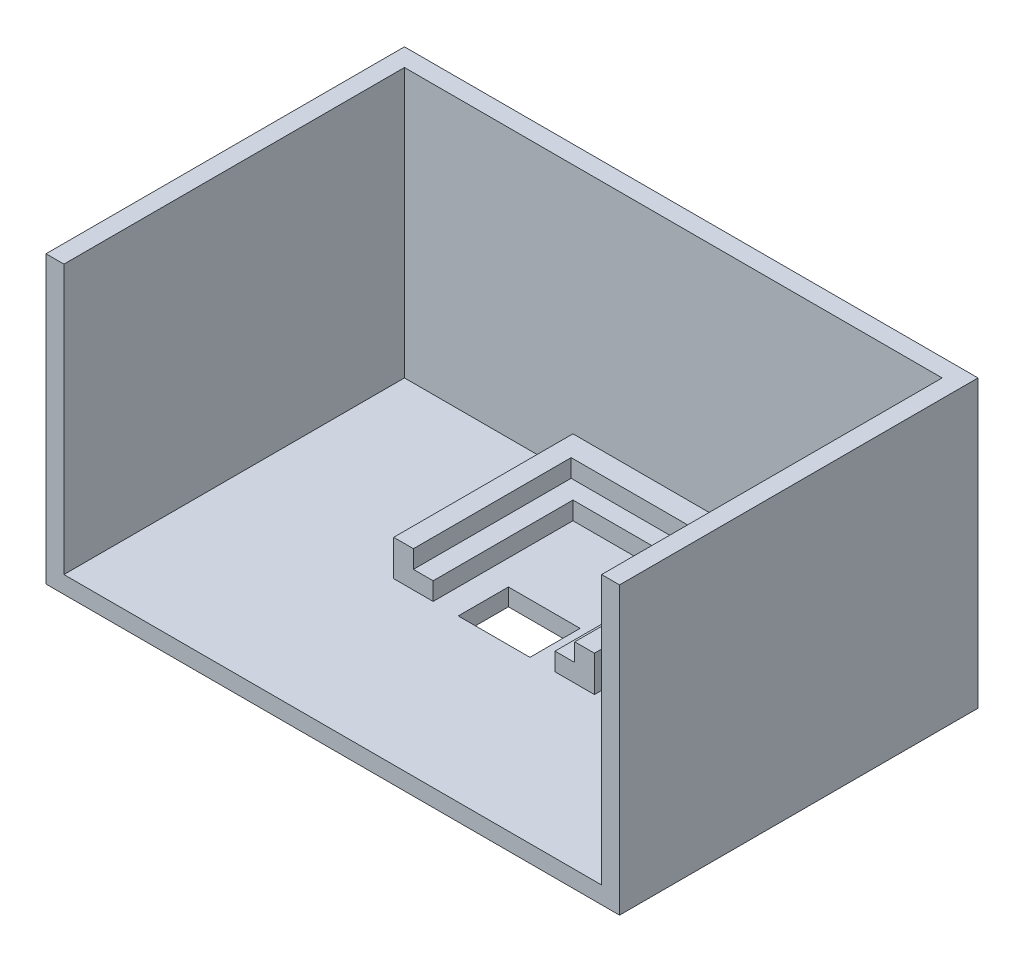
ISO-10303-21;
HEADER;
FILE_DESCRIPTION(('STEP AP214'),'2;1');
FILE_NAME('part.step','',(''),(''),'','','');
FILE_SCHEMA(('AUTOMOTIVE_DESIGN { 1 0 10303 214 1 1 1 1 }'));
ENDSEC;
DATA;
#1=APPLICATION_CONTEXT('core data for automotive mechanical design processes');
#2=APPLICATION_PROTOCOL_DEFINITION('international standard','automotive_design',2000,#1);
#3=PRODUCT_CONTEXT('',#1,'mechanical');
#4=PRODUCT('Part','Part','',(#3));
#5=PRODUCT_RELATED_PRODUCT_CATEGORY('part','',(#4));
#6=PRODUCT_DEFINITION_FORMATION('','',#4);
#7=PRODUCT_DEFINITION_CONTEXT('part definition',#1,'design');
#8=PRODUCT_DEFINITION('design','',#6,#7);
#9=PRODUCT_DEFINITION_SHAPE('','',#8);
#10=(LENGTH_UNIT() NAMED_UNIT(*) SI_UNIT(.MILLI.,.METRE.));
#11=(NAMED_UNIT(*) PLANE_ANGLE_UNIT() SI_UNIT($,.RADIAN.));
#12=(NAMED_UNIT(*) SI_UNIT($,.STERADIAN.) SOLID_ANGLE_UNIT());
#13=UNCERTAINTY_MEASURE_WITH_UNIT(LENGTH_MEASURE(1.E-05),#10,'distance_accuracy_value','');
#14=(GEOMETRIC_REPRESENTATION_CONTEXT(3) GLOBAL_UNCERTAINTY_ASSIGNED_CONTEXT((#13)) GLOBAL_UNIT_ASSIGNED_CONTEXT((#10,
#11,#12)) REPRESENTATION_CONTEXT('',''));
#15=CARTESIAN_POINT('',(0.,0.,0.));
#16=DIRECTION('',(0.,0.,1.));
#17=DIRECTION('',(1.,0.,0.));
#18=AXIS2_PLACEMENT_3D('',#15,#16,#17);
#19=CARTESIAN_POINT('',(-35.2096503229502,7.5,-34.0725635559515));
#20=DIRECTION('',(-1.,0.,0.));
#21=DIRECTION('',(0.,0.,1.));
#22=AXIS2_PLACEMENT_3D('',#19,#20,#21);
#23=PLANE('',#22);
#24=DIRECTION('',(0.,0.,-1.));
#25=VECTOR('',#24,1.);
#26=CARTESIAN_POINT('',(-35.2096503229502,5.,-34.0725635559515));
#27=LINE('',#26,#25);
#28=CARTESIAN_POINT('',(-35.2096503229502,5.,-14.5725635559515));
#29=VERTEX_POINT('',#28);
#30=CARTESIAN_POINT('',(-35.2096503229502,5.,-34.0725635559515));
#31=VERTEX_POINT('',#30);
#32=EDGE_CURVE('E240',#29,#31,#27,.T.);
#33=ORIENTED_EDGE('',*,*,#32,.F.);
#34=DIRECTION('',(0.,-1.,0.));
#35=VECTOR('',#34,1.);
#36=CARTESIAN_POINT('',(-35.2096503229502,7.5,-14.5725635559515));
#37=LINE('',#36,#35);
#38=CARTESIAN_POINT('',(-35.2096503229502,2.5,-14.5725635559515));
#39=VERTEX_POINT('',#38);
#40=EDGE_CURVE('E220',#29,#39,#37,.T.);
#41=ORIENTED_EDGE('',*,*,#40,.T.);
#42=DIRECTION('',(0.,0.,-1.));
#43=VECTOR('',#42,1.);
#44=CARTESIAN_POINT('',(-35.2096503229502,2.5,-34.0725635559515));
#45=LINE('',#44,#43);
#46=CARTESIAN_POINT('',(-35.2096503229502,2.5,-34.0725635559515));
#47=VERTEX_POINT('',#46);
#48=EDGE_CURVE('E284',#39,#47,#45,.T.);
#49=ORIENTED_EDGE('',*,*,#48,.T.);
#50=DIRECTION('',(0.,-1.,0.));
#51=VECTOR('',#50,1.);
#52=CARTESIAN_POINT('',(-35.2096503229502,7.5,-34.0725635559515));
#53=LINE('',#52,#51);
#54=EDGE_CURVE('E307',#31,#47,#53,.T.);
#55=ORIENTED_EDGE('',*,*,#54,.F.);
#56=EDGE_LOOP('',(#33,#41,#49,#55));
#57=FACE_BOUND('',#56,.T.);
#58=ADVANCED_FACE('F33',(#57),#23,.F.);
#59=CARTESIAN_POINT('',(-35.2096503229502,7.5,-34.0725635559515));
#60=DIRECTION('',(0.,0.,-1.));
#61=DIRECTION('',(-1.,0.,0.));
#62=AXIS2_PLACEMENT_3D('',#59,#60,#61);
#63=PLANE('',#62);
#64=DIRECTION('',(1.,0.,0.));
#65=VECTOR('',#64,1.);
#66=CARTESIAN_POINT('',(-35.2096503229502,5.,-34.0725635559515));
#67=LINE('',#66,#65);
#68=CARTESIAN_POINT('',(-18.2096503229502,5.,-34.0725635559515));
#69=VERTEX_POINT('',#68);
#70=EDGE_CURVE('E238',#31,#69,#67,.T.);
#71=ORIENTED_EDGE('',*,*,#70,.F.);
#72=ORIENTED_EDGE('',*,*,#54,.T.);
#73=DIRECTION('',(1.,0.,0.));
#74=VECTOR('',#73,1.);
#75=CARTESIAN_POINT('',(-35.2096503229502,2.5,-34.0725635559515));
#76=LINE('',#75,#74);
#77=CARTESIAN_POINT('',(-18.2096503229502,2.5,-34.0725635559515));
#78=VERTEX_POINT('',#77);
#79=EDGE_CURVE('E287',#47,#78,#76,.T.);
#80=ORIENTED_EDGE('',*,*,#79,.T.);
#81=DIRECTION('',(0.,-1.,0.));
#82=VECTOR('',#81,1.);
#83=CARTESIAN_POINT('',(-18.2096503229502,7.5,-34.0725635559515));
#84=LINE('',#83,#82);
#85=EDGE_CURVE('E305',#69,#78,#84,.T.);
#86=ORIENTED_EDGE('',*,*,#85,.F.);
#87=EDGE_LOOP('',(#71,#72,#80,#86));
#88=FACE_BOUND('',#87,.T.);
#89=ADVANCED_FACE('F410',(#88),#63,.F.);
#90=CARTESIAN_POINT('',(-18.2096503229502,7.5,-34.0725635559515));
#91=DIRECTION('',(1.,0.,0.));
#92=DIRECTION('',(0.,0.,-1.));
#93=AXIS2_PLACEMENT_3D('',#90,#91,#92);
#94=PLANE('',#93);
#95=DIRECTION('',(0.,0.,1.));
#96=VECTOR('',#95,1.);
#97=CARTESIAN_POINT('',(-18.2096503229502,5.,-34.0725635559515));
#98=LINE('',#97,#96);
#99=CARTESIAN_POINT('',(-18.2096503229502,5.,-14.5725635559515));
#100=VERTEX_POINT('',#99);
#101=EDGE_CURVE('E233',#69,#100,#98,.T.);
#102=ORIENTED_EDGE('',*,*,#101,.F.);
#103=ORIENTED_EDGE('',*,*,#85,.T.);
#104=DIRECTION('',(0.,0.,1.));
#105=VECTOR('',#104,1.);
#106=CARTESIAN_POINT('',(-18.2096503229502,2.5,-34.0725635559515));
#107=LINE('',#106,#105);
#108=CARTESIAN_POINT('',(-18.2096503229502,2.5,-14.5725635559515));
#109=VERTEX_POINT('',#108);
#110=EDGE_CURVE('E290',#78,#109,#107,.T.);
#111=ORIENTED_EDGE('',*,*,#110,.T.);
#112=DIRECTION('',(0.,-1.,0.));
#113=VECTOR('',#112,1.);
#114=CARTESIAN_POINT('',(-18.2096503229502,7.5,-14.5725635559515));
#115=LINE('',#114,#113);
#116=EDGE_CURVE('E303',#100,#109,#115,.T.);
#117=ORIENTED_EDGE('',*,*,#116,.F.);
#118=EDGE_LOOP('',(#102,#103,#111,#117));
#119=FACE_BOUND('',#118,.T.);
#120=ADVANCED_FACE('F404',(#119),#94,.F.);
#121=CARTESIAN_POINT('',(10.7903496770498,40.,-39.5725635559515));
#122=DIRECTION('',(0.,0.,1.));
#123=DIRECTION('',(1.,0.,0.));
#124=AXIS2_PLACEMENT_3D('',#121,#122,#123);
#125=PLANE('',#124);
#126=DIRECTION('',(-1.,0.,0.));
#127=VECTOR('',#126,1.);
#128=CARTESIAN_POINT('',(10.7903496770498,2.5,-39.5725635559515));
#129=LINE('',#128,#127);
#130=CARTESIAN_POINT('',(-40.7096503229501,2.5,-39.5725635559515));
#131=VERTEX_POINT('',#130);
#132=CARTESIAN_POINT('',(-64.2096503229501,2.5,-39.5725635559515));
#133=VERTEX_POINT('',#132);
#134=EDGE_CURVE('E336',#131,#133,#129,.T.);
#135=ORIENTED_EDGE('',*,*,#134,.F.);
#136=DIRECTION('',(0.,-1.,0.));
#137=VECTOR('',#136,1.);
#138=CARTESIAN_POINT('',(-40.7096503229501,7.5,-39.5725635559515));
#139=LINE('',#138,#137);
#140=CARTESIAN_POINT('',(-40.7096503229501,7.5,-39.5725635559515));
#141=VERTEX_POINT('',#140);
#142=EDGE_CURVE('E279',#141,#131,#139,.T.);
#143=ORIENTED_EDGE('',*,*,#142,.F.);
#144=DIRECTION('',(-1.,0.,0.));
#145=VECTOR('',#144,1.);
#146=CARTESIAN_POINT('',(-40.7096503229501,7.5,-39.5725635559515));
#147=LINE('',#146,#145);
#148=CARTESIAN_POINT('',(-12.7096503229502,7.5,-39.5725635559515));
#149=VERTEX_POINT('',#148);
#150=EDGE_CURVE('E277',#149,#141,#147,.T.);
#151=ORIENTED_EDGE('',*,*,#150,.F.);
#152=DIRECTION('',(0.,-1.,0.));
#153=VECTOR('',#152,1.);
#154=CARTESIAN_POINT('',(-12.7096503229502,7.5,-39.5725635559515));
#155=LINE('',#154,#153);
#156=CARTESIAN_POINT('',(-12.7096503229502,2.5,-39.5725635559515));
#157=VERTEX_POINT('',#156);
#158=EDGE_CURVE('E298',#149,#157,#155,.T.);
#159=ORIENTED_EDGE('',*,*,#158,.T.);
#160=CARTESIAN_POINT('',(10.7903496770498,2.5,-39.5725635559515));
#161=VERTEX_POINT('',#160);
#162=EDGE_CURVE('E327',#161,#157,#129,.T.);
#163=ORIENTED_EDGE('',*,*,#162,.F.);
#164=DIRECTION('',(0.,-1.,0.));
#165=VECTOR('',#164,1.);
#166=CARTESIAN_POINT('',(10.7903496770498,40.,-39.5725635559515));
#167=LINE('',#166,#165);
#168=CARTESIAN_POINT('',(10.7903496770498,40.,-39.5725635559515));
#169=VERTEX_POINT('',#168);
#170=EDGE_CURVE('E341',#169,#161,#167,.T.);
#171=ORIENTED_EDGE('',*,*,#170,.F.);
#172=DIRECTION('',(-1.,0.,0.));
#173=VECTOR('',#172,1.);
#174=CARTESIAN_POINT('',(10.7903496770498,40.,-39.5725635559515));
#175=LINE('',#174,#173);
#176=CARTESIAN_POINT('',(-64.2096503229501,40.,-39.5725635559515));
#177=VERTEX_POINT('',#176);
#178=EDGE_CURVE('E330',#169,#177,#175,.T.);
#179=ORIENTED_EDGE('',*,*,#178,.T.);
#180=DIRECTION('',(0.,-1.,0.));
#181=VECTOR('',#180,1.);
#182=CARTESIAN_POINT('',(-64.2096503229501,40.,-39.5725635559515));
#183=LINE('',#182,#181);
#184=EDGE_CURVE('E332',#177,#133,#183,.T.);
#185=ORIENTED_EDGE('',*,*,#184,.T.);
#186=EDGE_LOOP('',(#135,#143,#151,#159,#163,#171,#179,#185));
#187=FACE_BOUND('',#186,.T.);
#188=ADVANCED_FACE('F395',(#187),#125,.T.);
#189=CARTESIAN_POINT('',(0.,2.5,0.));
#190=DIRECTION('',(0.,1.,0.));
#191=DIRECTION('',(0.,0.,1.));
#192=AXIS2_PLACEMENT_3D('',#189,#190,#191);
#193=PLANE('',#192);
#194=DIRECTION('',(1.,0.,0.));
#195=VECTOR('',#194,1.);
#196=CARTESIAN_POINT('',(-20.4048902164909,2.5,7.92743644404847));
#197=LINE('',#196,#195);
#198=CARTESIAN_POINT('',(-64.2096503229501,2.5,7.92743644404847));
#199=VERTEX_POINT('',#198);
#200=CARTESIAN_POINT('',(10.7903496770498,2.5,7.92743644404847));
#201=VERTEX_POINT('',#200);
#202=EDGE_CURVE('E320',#199,#201,#197,.T.);
#203=ORIENTED_EDGE('',*,*,#202,.T.);
#204=DIRECTION('',(0.,0.,-1.));
#205=VECTOR('',#204,1.);
#206=CARTESIAN_POINT('',(10.7903496770498,2.5,5.42743644404847));
#207=LINE('',#206,#205);
#208=EDGE_CURVE('E334',#201,#161,#207,.T.);
#209=ORIENTED_EDGE('',*,*,#208,.T.);
#210=ORIENTED_EDGE('',*,*,#162,.T.);
#211=DIRECTION('',(0.,0.,-1.));
#212=VECTOR('',#211,1.);
#213=CARTESIAN_POINT('',(-12.7096503229502,2.5,-39.5725635559515));
#214=LINE('',#213,#212);
#215=CARTESIAN_POINT('',(-12.7096503229502,2.5,-14.5725635559515));
#216=VERTEX_POINT('',#215);
#217=EDGE_CURVE('E271',#216,#157,#214,.T.);
#218=ORIENTED_EDGE('',*,*,#217,.F.);
#219=DIRECTION('',(1.,0.,0.));
#220=VECTOR('',#219,1.);
#221=CARTESIAN_POINT('',(-12.7096503229502,2.5,-14.5725635559515));
#222=LINE('',#221,#220);
#223=EDGE_CURVE('E293',#109,#216,#222,.T.);
#224=ORIENTED_EDGE('',*,*,#223,.F.);
#225=ORIENTED_EDGE('',*,*,#110,.F.);
#226=ORIENTED_EDGE('',*,*,#79,.F.);
#227=ORIENTED_EDGE('',*,*,#48,.F.);
#228=DIRECTION('',(1.,0.,0.));
#229=VECTOR('',#228,1.);
#230=CARTESIAN_POINT('',(-35.2096503229502,2.5,-14.5725635559515));
#231=LINE('',#230,#229);
#232=CARTESIAN_POINT('',(-40.7096503229501,2.5,-14.5725635559515));
#233=VERTEX_POINT('',#232);
#234=EDGE_CURVE('E282',#233,#39,#231,.T.);
#235=ORIENTED_EDGE('',*,*,#234,.F.);
#236=DIRECTION('',(0.,0.,1.));
#237=VECTOR('',#236,1.);
#238=CARTESIAN_POINT('',(-40.7096503229501,2.5,-39.5725635559515));
#239=LINE('',#238,#237);
#240=EDGE_CURVE('E261',#131,#233,#239,.T.);
#241=ORIENTED_EDGE('',*,*,#240,.F.);
#242=ORIENTED_EDGE('',*,*,#134,.T.);
#243=DIRECTION('',(0.,0.,1.));
#244=VECTOR('',#243,1.);
#245=CARTESIAN_POINT('',(-64.2096503229501,2.5,5.42743644404847));
#246=LINE('',#245,#244);
#247=EDGE_CURVE('E323',#133,#199,#246,.T.);
#248=ORIENTED_EDGE('',*,*,#247,.T.);
#249=EDGE_LOOP('',(#203,#209,#210,#218,#224,#225,#226,#227,#235,#241,#242,#248));
#250=FACE_BOUND('',#249,.T.);
#251=DIRECTION('',(0.,0.,1.));
#252=VECTOR('',#251,1.);
#253=CARTESIAN_POINT('',(-31.7096503229502,2.5,-14.5725635559515));
#254=LINE('',#253,#252);
#255=CARTESIAN_POINT('',(-31.7096503229502,2.5,-21.5725635559515));
#256=VERTEX_POINT('',#255);
#257=CARTESIAN_POINT('',(-31.7096503229502,2.5,-14.5725635559515));
#258=VERTEX_POINT('',#257);
#259=EDGE_CURVE('E56',#256,#258,#254,.T.);
#260=ORIENTED_EDGE('',*,*,#259,.F.);
#261=DIRECTION('',(-1.,0.,0.));
#262=VECTOR('',#261,1.);
#263=CARTESIAN_POINT('',(-31.7096503229502,2.5,-21.5725635559515));
#264=LINE('',#263,#262);
#265=CARTESIAN_POINT('',(-21.7096503229502,2.5,-21.5725635559515));
#266=VERTEX_POINT('',#265);
#267=EDGE_CURVE('E255',#266,#256,#264,.T.);
#268=ORIENTED_EDGE('',*,*,#267,.F.);
#269=DIRECTION('',(0.,0.,-1.));
#270=VECTOR('',#269,1.);
#271=CARTESIAN_POINT('',(-21.7096503229502,2.5,-14.5725635559515));
#272=LINE('',#271,#270);
#273=CARTESIAN_POINT('',(-21.7096503229502,2.5,-14.5725635559515));
#274=VERTEX_POINT('',#273);
#275=EDGE_CURVE('E252',#274,#266,#272,.T.);
#276=ORIENTED_EDGE('',*,*,#275,.F.);
#277=DIRECTION('',(1.,0.,0.));
#278=VECTOR('',#277,1.);
#279=CARTESIAN_POINT('',(-31.7096503229502,2.5,-14.5725635559515));
#280=LINE('',#279,#278);
#281=EDGE_CURVE('E249',#258,#274,#280,.T.);
#282=ORIENTED_EDGE('',*,*,#281,.F.);
#283=EDGE_LOOP('',(#260,#268,#276,#282));
#284=FACE_BOUND('',#283,.T.);
#285=ADVANCED_FACE('F393',(#250,#284),#193,.T.);
#286=CARTESIAN_POINT('',(-66.7096503229502,2.5,-42.0725635559515));
#287=DIRECTION('',(1.,0.,0.));
#288=DIRECTION('',(0.,0.,-1.));
#289=AXIS2_PLACEMENT_3D('',#286,#287,#288);
#290=PLANE('',#289);
#291=DIRECTION('',(0.,0.,-1.));
#292=VECTOR('',#291,1.);
#293=CARTESIAN_POINT('',(-66.7096503229502,0.1,7.92743644404848));
#294=LINE('',#293,#292);
#295=CARTESIAN_POINT('',(-66.7096503229502,0.1,7.92743644404848));
#296=VERTEX_POINT('',#295);
#297=CARTESIAN_POINT('',(-66.7096503229502,0.0999999999999998,-42.0725635559515));
#298=VERTEX_POINT('',#297);
#299=EDGE_CURVE('E312',#296,#298,#294,.T.);
#300=ORIENTED_EDGE('',*,*,#299,.F.);
#301=DIRECTION('',(0.,-1.,0.));
#302=VECTOR('',#301,1.);
#303=CARTESIAN_POINT('',(-66.7096503229502,2.5,7.92743644404848));
#304=LINE('',#303,#302);
#305=CARTESIAN_POINT('',(-66.7096503229502,40.,7.92743644404847));
#306=VERTEX_POINT('',#305);
#307=EDGE_CURVE('E366',#306,#296,#304,.T.);
#308=ORIENTED_EDGE('',*,*,#307,.F.);
#309=DIRECTION('',(0.,0.,1.));
#310=VECTOR('',#309,1.);
#311=CARTESIAN_POINT('',(-66.7096503229502,40.,-42.0725635559515));
#312=LINE('',#311,#310);
#313=CARTESIAN_POINT('',(-66.7096503229502,40.,-42.0725635559515));
#314=VERTEX_POINT('',#313);
#315=EDGE_CURVE('E344',#314,#306,#312,.T.);
#316=ORIENTED_EDGE('',*,*,#315,.F.);
#317=DIRECTION('',(0.,-1.,0.));
#318=VECTOR('',#317,1.);
#319=CARTESIAN_POINT('',(-66.7096503229502,2.5,-42.0725635559515));
#320=LINE('',#319,#318);
#321=EDGE_CURVE('E357',#314,#298,#320,.T.);
#322=ORIENTED_EDGE('',*,*,#321,.T.);
#323=EDGE_LOOP('',(#300,#308,#316,#322));
#324=FACE_BOUND('',#323,.T.);
#325=ADVANCED_FACE('F35',(#324),#290,.F.);
#326=CARTESIAN_POINT('',(-66.7096503229502,2.5,7.92743644404848));
#327=DIRECTION('',(0.,0.,-1.));
#328=DIRECTION('',(-1.,0.,0.));
#329=AXIS2_PLACEMENT_3D('',#326,#327,#328);
#330=PLANE('',#329);
#331=DIRECTION('',(1.,0.,0.));
#332=VECTOR('',#331,1.);
#333=CARTESIAN_POINT('',(-66.7096503229502,40.,7.92743644404847));
#334=LINE('',#333,#332);
#335=CARTESIAN_POINT('',(10.7903496770498,40.,7.92743644404847));
#336=VERTEX_POINT('',#335);
#337=CARTESIAN_POINT('',(13.2903496770499,40.,7.92743644404847));
#338=VERTEX_POINT('',#337);
#339=EDGE_CURVE('E347',#336,#338,#334,.T.);
#340=ORIENTED_EDGE('',*,*,#339,.F.);
#341=DIRECTION('',(0.,-1.,0.));
#342=VECTOR('',#341,1.);
#343=CARTESIAN_POINT('',(10.7903496770499,2.5,7.92743644404847));
#344=LINE('',#343,#342);
#345=EDGE_CURVE('E245',#336,#201,#344,.T.);
#346=ORIENTED_EDGE('',*,*,#345,.T.);
#347=ORIENTED_EDGE('',*,*,#202,.F.);
#348=DIRECTION('',(0.,1.,0.));
#349=VECTOR('',#348,1.);
#350=CARTESIAN_POINT('',(-64.2096503229501,2.5,7.92743644404848));
#351=LINE('',#350,#349);
#352=CARTESIAN_POINT('',(-64.2096503229501,40.,7.92743644404847));
#353=VERTEX_POINT('',#352);
#354=EDGE_CURVE('E242',#199,#353,#351,.T.);
#355=ORIENTED_EDGE('',*,*,#354,.T.);
#356=EDGE_CURVE('E348',#306,#353,#334,.T.);
#357=ORIENTED_EDGE('',*,*,#356,.F.);
#358=ORIENTED_EDGE('',*,*,#307,.T.);
#359=DIRECTION('',(-1.,0.,0.));
#360=VECTOR('',#359,1.);
#361=CARTESIAN_POINT('',(-66.7096503229502,0.1,7.92743644404848));
#362=LINE('',#361,#360);
#363=CARTESIAN_POINT('',(13.2903496770499,0.1,7.92743644404848));
#364=VERTEX_POINT('',#363);
#365=EDGE_CURVE('E318',#364,#296,#362,.T.);
#366=ORIENTED_EDGE('',*,*,#365,.F.);
#367=DIRECTION('',(0.,-1.,0.));
#368=VECTOR('',#367,1.);
#369=CARTESIAN_POINT('',(13.2903496770499,2.5,7.92743644404847));
#370=LINE('',#369,#368);
#371=EDGE_CURVE('E363',#338,#364,#370,.T.);
#372=ORIENTED_EDGE('',*,*,#371,.F.);
#373=EDGE_LOOP('',(#340,#346,#347,#355,#357,#358,#366,#372));
#374=FACE_BOUND('',#373,.T.);
#375=ADVANCED_FACE('F402',(#374),#330,.F.);
#376=CARTESIAN_POINT('',(13.2903496770499,2.5,-42.0725635559515));
#377=DIRECTION('',(-1.,0.,0.));
#378=DIRECTION('',(0.,0.,1.));
#379=AXIS2_PLACEMENT_3D('',#376,#377,#378);
#380=PLANE('',#379);
#381=DIRECTION('',(0.,0.,1.));
#382=VECTOR('',#381,1.);
#383=CARTESIAN_POINT('',(13.2903496770499,0.1,7.92743644404848));
#384=LINE('',#383,#382);
#385=CARTESIAN_POINT('',(13.2903496770499,0.1,-42.0725635559515));
#386=VERTEX_POINT('',#385);
#387=EDGE_CURVE('E316',#386,#364,#384,.T.);
#388=ORIENTED_EDGE('',*,*,#387,.F.);
#389=DIRECTION('',(0.,-1.,0.));
#390=VECTOR('',#389,1.);
#391=CARTESIAN_POINT('',(13.2903496770499,2.5,-42.0725635559515));
#392=LINE('',#391,#390);
#393=CARTESIAN_POINT('',(13.2903496770499,40.,-42.0725635559515));
#394=VERTEX_POINT('',#393);
#395=EDGE_CURVE('E360',#394,#386,#392,.T.);
#396=ORIENTED_EDGE('',*,*,#395,.F.);
#397=DIRECTION('',(0.,0.,-1.));
#398=VECTOR('',#397,1.);
#399=CARTESIAN_POINT('',(13.2903496770499,40.,-42.0725635559515));
#400=LINE('',#399,#398);
#401=EDGE_CURVE('E351',#338,#394,#400,.T.);
#402=ORIENTED_EDGE('',*,*,#401,.F.);
#403=ORIENTED_EDGE('',*,*,#371,.T.);
#404=EDGE_LOOP('',(#388,#396,#402,#403));
#405=FACE_BOUND('',#404,.T.);
#406=ADVANCED_FACE('F443',(#405),#380,.F.);
#407=CARTESIAN_POINT('',(-66.7096503229502,2.5,-42.0725635559515));
#408=DIRECTION('',(0.,0.,1.));
#409=DIRECTION('',(1.,0.,0.));
#410=AXIS2_PLACEMENT_3D('',#407,#408,#409);
#411=PLANE('',#410);
#412=DIRECTION('',(1.,0.,0.));
#413=VECTOR('',#412,1.);
#414=CARTESIAN_POINT('',(-66.7096503229502,0.1,-42.0725635559515));
#415=LINE('',#414,#413);
#416=EDGE_CURVE('E314',#298,#386,#415,.T.);
#417=ORIENTED_EDGE('',*,*,#416,.F.);
#418=ORIENTED_EDGE('',*,*,#321,.F.);
#419=DIRECTION('',(-1.,0.,0.));
#420=VECTOR('',#419,1.);
#421=CARTESIAN_POINT('',(-66.7096503229502,40.,-42.0725635559515));
#422=LINE('',#421,#420);
#423=EDGE_CURVE('E354',#394,#314,#422,.T.);
#424=ORIENTED_EDGE('',*,*,#423,.F.);
#425=ORIENTED_EDGE('',*,*,#395,.T.);
#426=EDGE_LOOP('',(#417,#418,#424,#425));
#427=FACE_BOUND('',#426,.T.);
#428=ADVANCED_FACE('F438',(#427),#411,.F.);
#429=CARTESIAN_POINT('',(0.,40.,0.));
#430=DIRECTION('',(0.,1.,0.));
#431=DIRECTION('',(0.,0.,1.));
#432=AXIS2_PLACEMENT_3D('',#429,#430,#431);
#433=PLANE('',#432);
#434=DIRECTION('',(0.,0.,-1.));
#435=VECTOR('',#434,1.);
#436=CARTESIAN_POINT('',(10.7903496770498,40.,5.42743644404847));
#437=LINE('',#436,#435);
#438=EDGE_CURVE('E326',#336,#169,#437,.T.);
#439=ORIENTED_EDGE('',*,*,#438,.F.);
#440=ORIENTED_EDGE('',*,*,#339,.T.);
#441=ORIENTED_EDGE('',*,*,#401,.T.);
#442=ORIENTED_EDGE('',*,*,#423,.T.);
#443=ORIENTED_EDGE('',*,*,#315,.T.);
#444=ORIENTED_EDGE('',*,*,#356,.T.);
#445=DIRECTION('',(0.,0.,1.));
#446=VECTOR('',#445,1.);
#447=CARTESIAN_POINT('',(-64.2096503229501,40.,5.42743644404847));
#448=LINE('',#447,#446);
#449=EDGE_CURVE('E324',#177,#353,#448,.T.);
#450=ORIENTED_EDGE('',*,*,#449,.F.);
#451=ORIENTED_EDGE('',*,*,#178,.F.);
#452=EDGE_LOOP('',(#439,#440,#441,#442,#443,#444,#450,#451));
#453=FACE_BOUND('',#452,.T.);
#454=ADVANCED_FACE('F435',(#453),#433,.T.);
#455=CARTESIAN_POINT('',(-64.2096503229501,40.,5.42743644404847));
#456=DIRECTION('',(1.,0.,0.));
#457=DIRECTION('',(0.,0.,-1.));
#458=AXIS2_PLACEMENT_3D('',#455,#456,#457);
#459=PLANE('',#458);
#460=ORIENTED_EDGE('',*,*,#247,.F.);
#461=ORIENTED_EDGE('',*,*,#184,.F.);
#462=ORIENTED_EDGE('',*,*,#449,.T.);
#463=ORIENTED_EDGE('',*,*,#354,.F.);
#464=EDGE_LOOP('',(#460,#461,#462,#463));
#465=FACE_BOUND('',#464,.T.);
#466=ADVANCED_FACE('F432',(#465),#459,.T.);
#467=CARTESIAN_POINT('',(10.7903496770498,40.,5.42743644404847));
#468=DIRECTION('',(-1.,0.,0.));
#469=DIRECTION('',(0.,0.,1.));
#470=AXIS2_PLACEMENT_3D('',#467,#468,#469);
#471=PLANE('',#470);
#472=ORIENTED_EDGE('',*,*,#208,.F.);
#473=ORIENTED_EDGE('',*,*,#345,.F.);
#474=ORIENTED_EDGE('',*,*,#438,.T.);
#475=ORIENTED_EDGE('',*,*,#170,.T.);
#476=EDGE_LOOP('',(#472,#473,#474,#475));
#477=FACE_BOUND('',#476,.T.);
#478=ADVANCED_FACE('F428',(#477),#471,.T.);
#479=CARTESIAN_POINT('',(0.,0.1,0.));
#480=DIRECTION('',(0.,-1.,0.));
#481=DIRECTION('',(0.,0.,-1.));
#482=AXIS2_PLACEMENT_3D('',#479,#480,#481);
#483=PLANE('',#482);
#484=DIRECTION('',(0.,0.,-1.));
#485=VECTOR('',#484,1.);
#486=CARTESIAN_POINT('',(-31.7096503229502,0.1,0.));
#487=LINE('',#486,#485);
#488=CARTESIAN_POINT('',(-31.7096503229502,0.1,-14.5725635559515));
#489=VERTEX_POINT('',#488);
#490=CARTESIAN_POINT('',(-31.7096503229502,0.1,-21.5725635559515));
#491=VERTEX_POINT('',#490);
#492=EDGE_CURVE('E11',#489,#491,#487,.T.);
#493=ORIENTED_EDGE('',*,*,#492,.F.);
#494=DIRECTION('',(-1.,0.,0.));
#495=VECTOR('',#494,1.);
#496=CARTESIAN_POINT('',(0.,0.1,-14.5725635559515));
#497=LINE('',#496,#495);
#498=CARTESIAN_POINT('',(-21.7096503229502,0.1,-14.5725635559515));
#499=VERTEX_POINT('',#498);
#500=EDGE_CURVE('E369',#499,#489,#497,.T.);
#501=ORIENTED_EDGE('',*,*,#500,.F.);
#502=DIRECTION('',(0.,0.,1.));
#503=VECTOR('',#502,1.);
#504=CARTESIAN_POINT('',(-21.7096503229502,0.1,0.));
#505=LINE('',#504,#503);
#506=CARTESIAN_POINT('',(-21.7096503229502,0.1,-21.5725635559515));
#507=VERTEX_POINT('',#506);
#508=EDGE_CURVE('E371',#507,#499,#505,.T.);
#509=ORIENTED_EDGE('',*,*,#508,.F.);
#510=DIRECTION('',(1.,0.,0.));
#511=VECTOR('',#510,1.);
#512=CARTESIAN_POINT('',(0.,0.1,-21.5725635559515));
#513=LINE('',#512,#511);
#514=EDGE_CURVE('E41',#491,#507,#513,.T.);
#515=ORIENTED_EDGE('',*,*,#514,.F.);
#516=EDGE_LOOP('',(#493,#501,#509,#515));
#517=FACE_BOUND('',#516,.T.);
#518=ORIENTED_EDGE('',*,*,#299,.T.);
#519=ORIENTED_EDGE('',*,*,#416,.T.);
#520=ORIENTED_EDGE('',*,*,#387,.T.);
#521=ORIENTED_EDGE('',*,*,#365,.T.);
#522=EDGE_LOOP('',(#518,#519,#520,#521));
#523=FACE_BOUND('',#522,.T.);
#524=ADVANCED_FACE('F386',(#517,#523),#483,.T.);
#525=CARTESIAN_POINT('',(-40.7096503229501,7.5,-39.5725635559515));
#526=DIRECTION('',(1.,0.,0.));
#527=DIRECTION('',(0.,0.,-1.));
#528=AXIS2_PLACEMENT_3D('',#525,#526,#527);
#529=PLANE('',#528);
#530=ORIENTED_EDGE('',*,*,#240,.T.);
#531=DIRECTION('',(0.,-1.,0.));
#532=VECTOR('',#531,1.);
#533=CARTESIAN_POINT('',(-40.7096503229501,7.5,-14.5725635559515));
#534=LINE('',#533,#532);
#535=CARTESIAN_POINT('',(-40.7096503229501,7.5,-14.5725635559515));
#536=VERTEX_POINT('',#535);
#537=EDGE_CURVE('E310',#536,#233,#534,.T.);
#538=ORIENTED_EDGE('',*,*,#537,.F.);
#539=DIRECTION('',(0.,0.,1.));
#540=VECTOR('',#539,1.);
#541=CARTESIAN_POINT('',(-40.7096503229501,7.5,-39.5725635559515));
#542=LINE('',#541,#540);
#543=EDGE_CURVE('E267',#141,#536,#542,.T.);
#544=ORIENTED_EDGE('',*,*,#543,.F.);
#545=ORIENTED_EDGE('',*,*,#142,.T.);
#546=EDGE_LOOP('',(#530,#538,#544,#545));
#547=FACE_BOUND('',#546,.T.);
#548=ADVANCED_FACE('F423',(#547),#529,.F.);
#549=CARTESIAN_POINT('',(-35.2096503229502,7.5,-14.5725635559515));
#550=DIRECTION('',(0.,0.,-1.));
#551=DIRECTION('',(-1.,0.,0.));
#552=AXIS2_PLACEMENT_3D('',#549,#550,#551);
#553=PLANE('',#552);
#554=DIRECTION('',(1.,0.,0.));
#555=VECTOR('',#554,1.);
#556=CARTESIAN_POINT('',(-37.9596503229501,5.,-14.5725635559515));
#557=LINE('',#556,#555);
#558=CARTESIAN_POINT('',(-37.9596503229501,5.,-14.5725635559515));
#559=VERTEX_POINT('',#558);
#560=EDGE_CURVE('E210',#559,#29,#557,.T.);
#561=ORIENTED_EDGE('',*,*,#560,.F.);
#562=DIRECTION('',(0.,1.,0.));
#563=VECTOR('',#562,1.);
#564=CARTESIAN_POINT('',(-37.9596503229501,5.,-14.5725635559515));
#565=LINE('',#564,#563);
#566=CARTESIAN_POINT('',(-37.9596503229501,7.5,-14.5725635559515));
#567=VERTEX_POINT('',#566);
#568=EDGE_CURVE('E196',#559,#567,#565,.T.);
#569=ORIENTED_EDGE('',*,*,#568,.T.);
#570=DIRECTION('',(1.,0.,0.));
#571=VECTOR('',#570,1.);
#572=CARTESIAN_POINT('',(-35.2096503229502,7.5,-14.5725635559515));
#573=LINE('',#572,#571);
#574=EDGE_CURVE('E270',#536,#567,#573,.T.);
#575=ORIENTED_EDGE('',*,*,#574,.F.);
#576=ORIENTED_EDGE('',*,*,#537,.T.);
#577=ORIENTED_EDGE('',*,*,#234,.T.);
#578=ORIENTED_EDGE('',*,*,#40,.F.);
#579=EDGE_LOOP('',(#561,#569,#575,#576,#577,#578));
#580=FACE_BOUND('',#579,.T.);
#581=ADVANCED_FACE('F218',(#580),#553,.F.);
#582=CARTESIAN_POINT('',(-12.7096503229502,7.5,-14.5725635559515));
#583=DIRECTION('',(0.,0.,-1.));
#584=DIRECTION('',(-1.,0.,0.));
#585=AXIS2_PLACEMENT_3D('',#582,#583,#584);
#586=PLANE('',#585);
#587=DIRECTION('',(1.,0.,0.));
#588=VECTOR('',#587,1.);
#589=CARTESIAN_POINT('',(-12.7096503229502,7.5,-14.5725635559515));
#590=LINE('',#589,#588);
#591=CARTESIAN_POINT('',(-15.4596503229501,7.5,-14.5725635559515));
#592=VERTEX_POINT('',#591);
#593=CARTESIAN_POINT('',(-12.7096503229502,7.5,-14.5725635559515));
#594=VERTEX_POINT('',#593);
#595=EDGE_CURVE('E273',#592,#594,#590,.T.);
#596=ORIENTED_EDGE('',*,*,#595,.F.);
#597=DIRECTION('',(0.,1.,0.));
#598=VECTOR('',#597,1.);
#599=CARTESIAN_POINT('',(-15.4596503229501,5.,-14.5725635559515));
#600=LINE('',#599,#598);
#601=CARTESIAN_POINT('',(-15.4596503229501,5.,-14.5725635559515));
#602=VERTEX_POINT('',#601);
#603=EDGE_CURVE('E48',#602,#592,#600,.T.);
#604=ORIENTED_EDGE('',*,*,#603,.F.);
#605=EDGE_CURVE('E214',#100,#602,#557,.T.);
#606=ORIENTED_EDGE('',*,*,#605,.F.);
#607=ORIENTED_EDGE('',*,*,#116,.T.);
#608=ORIENTED_EDGE('',*,*,#223,.T.);
#609=DIRECTION('',(0.,-1.,0.));
#610=VECTOR('',#609,1.);
#611=CARTESIAN_POINT('',(-12.7096503229502,7.5,-14.5725635559515));
#612=LINE('',#611,#610);
#613=EDGE_CURVE('E301',#594,#216,#612,.T.);
#614=ORIENTED_EDGE('',*,*,#613,.F.);
#615=EDGE_LOOP('',(#596,#604,#606,#607,#608,#614));
#616=FACE_BOUND('',#615,.T.);
#617=ADVANCED_FACE('F422',(#616),#586,.F.);
#618=CARTESIAN_POINT('',(-12.7096503229502,7.5,-39.5725635559515));
#619=DIRECTION('',(-1.,0.,0.));
#620=DIRECTION('',(0.,0.,1.));
#621=AXIS2_PLACEMENT_3D('',#618,#619,#620);
#622=PLANE('',#621);
#623=ORIENTED_EDGE('',*,*,#217,.T.);
#624=ORIENTED_EDGE('',*,*,#158,.F.);
#625=DIRECTION('',(0.,0.,-1.));
#626=VECTOR('',#625,1.);
#627=CARTESIAN_POINT('',(-12.7096503229502,7.5,-39.5725635559515));
#628=LINE('',#627,#626);
#629=EDGE_CURVE('E275',#594,#149,#628,.T.);
#630=ORIENTED_EDGE('',*,*,#629,.F.);
#631=ORIENTED_EDGE('',*,*,#613,.T.);
#632=EDGE_LOOP('',(#623,#624,#630,#631));
#633=FACE_BOUND('',#632,.T.);
#634=ADVANCED_FACE('F482',(#633),#622,.F.);
#635=CARTESIAN_POINT('',(0.,7.5,0.));
#636=DIRECTION('',(0.,-1.,0.));
#637=DIRECTION('',(0.,0.,-1.));
#638=AXIS2_PLACEMENT_3D('',#635,#636,#637);
#639=PLANE('',#638);
#640=ORIENTED_EDGE('',*,*,#574,.T.);
#641=DIRECTION('',(0.,0.,1.));
#642=VECTOR('',#641,1.);
#643=CARTESIAN_POINT('',(-37.9596503229501,7.5,-36.5725635559515));
#644=LINE('',#643,#642);
#645=CARTESIAN_POINT('',(-37.9596503229501,7.5,-36.5725635559515));
#646=VERTEX_POINT('',#645);
#647=EDGE_CURVE('E202',#646,#567,#644,.T.);
#648=ORIENTED_EDGE('',*,*,#647,.F.);
#649=DIRECTION('',(-1.,0.,0.));
#650=VECTOR('',#649,1.);
#651=CARTESIAN_POINT('',(-37.9596503229501,7.5,-36.5725635559515));
#652=LINE('',#651,#650);
#653=CARTESIAN_POINT('',(-15.4596503229501,7.5,-36.5725635559515));
#654=VERTEX_POINT('',#653);
#655=EDGE_CURVE('E215',#654,#646,#652,.T.);
#656=ORIENTED_EDGE('',*,*,#655,.F.);
#657=DIRECTION('',(0.,0.,-1.));
#658=VECTOR('',#657,1.);
#659=CARTESIAN_POINT('',(-15.4596503229501,7.5,-36.5725635559515));
#660=LINE('',#659,#658);
#661=EDGE_CURVE('E227',#592,#654,#660,.T.);
#662=ORIENTED_EDGE('',*,*,#661,.F.);
#663=ORIENTED_EDGE('',*,*,#595,.T.);
#664=ORIENTED_EDGE('',*,*,#629,.T.);
#665=ORIENTED_EDGE('',*,*,#150,.T.);
#666=ORIENTED_EDGE('',*,*,#543,.T.);
#667=EDGE_LOOP('',(#640,#648,#656,#662,#663,#664,#665,#666));
#668=FACE_BOUND('',#667,.T.);
#669=ADVANCED_FACE('F477',(#668),#639,.F.);
#670=CARTESIAN_POINT('',(-31.7096503229502,-7.5,-14.5725635559515));
#671=DIRECTION('',(-1.,0.,0.));
#672=DIRECTION('',(0.,0.,1.));
#673=AXIS2_PLACEMENT_3D('',#670,#671,#672);
#674=PLANE('',#673);
#675=ORIENTED_EDGE('',*,*,#492,.T.);
#676=DIRECTION('',(0.,1.,0.));
#677=VECTOR('',#676,1.);
#678=CARTESIAN_POINT('',(-31.7096503229502,-7.5,-21.5725635559515));
#679=LINE('',#678,#677);
#680=EDGE_CURVE('E259',#491,#256,#679,.T.);
#681=ORIENTED_EDGE('',*,*,#680,.T.);
#682=ORIENTED_EDGE('',*,*,#259,.T.);
#683=DIRECTION('',(0.,1.,0.));
#684=VECTOR('',#683,1.);
#685=CARTESIAN_POINT('',(-31.7096503229502,-7.5,-14.5725635559515));
#686=LINE('',#685,#684);
#687=EDGE_CURVE('E258',#489,#258,#686,.T.);
#688=ORIENTED_EDGE('',*,*,#687,.F.);
#689=EDGE_LOOP('',(#675,#681,#682,#688));
#690=FACE_BOUND('',#689,.T.);
#691=ADVANCED_FACE('F391',(#690),#674,.F.);
#692=CARTESIAN_POINT('',(-31.7096503229502,-7.5,-21.5725635559515));
#693=DIRECTION('',(0.,0.,-1.));
#694=DIRECTION('',(-1.,0.,0.));
#695=AXIS2_PLACEMENT_3D('',#692,#693,#694);
#696=PLANE('',#695);
#697=ORIENTED_EDGE('',*,*,#514,.T.);
#698=DIRECTION('',(0.,1.,0.));
#699=VECTOR('',#698,1.);
#700=CARTESIAN_POINT('',(-21.7096503229502,-7.5,-21.5725635559515));
#701=LINE('',#700,#699);
#702=EDGE_CURVE('E262',#507,#266,#701,.T.);
#703=ORIENTED_EDGE('',*,*,#702,.T.);
#704=ORIENTED_EDGE('',*,*,#267,.T.);
#705=ORIENTED_EDGE('',*,*,#680,.F.);
#706=EDGE_LOOP('',(#697,#703,#704,#705));
#707=FACE_BOUND('',#706,.T.);
#708=ADVANCED_FACE('F377',(#707),#696,.F.);
#709=CARTESIAN_POINT('',(-21.7096503229502,-7.5,-14.5725635559515));
#710=DIRECTION('',(1.,0.,0.));
#711=DIRECTION('',(0.,0.,-1.));
#712=AXIS2_PLACEMENT_3D('',#709,#710,#711);
#713=PLANE('',#712);
#714=ORIENTED_EDGE('',*,*,#508,.T.);
#715=DIRECTION('',(0.,1.,0.));
#716=VECTOR('',#715,1.);
#717=CARTESIAN_POINT('',(-21.7096503229502,-7.5,-14.5725635559515));
#718=LINE('',#717,#716);
#719=EDGE_CURVE('E264',#499,#274,#718,.T.);
#720=ORIENTED_EDGE('',*,*,#719,.T.);
#721=ORIENTED_EDGE('',*,*,#275,.T.);
#722=ORIENTED_EDGE('',*,*,#702,.F.);
#723=EDGE_LOOP('',(#714,#720,#721,#722));
#724=FACE_BOUND('',#723,.T.);
#725=ADVANCED_FACE('F382',(#724),#713,.F.);
#726=CARTESIAN_POINT('',(-31.7096503229502,-7.5,-14.5725635559515));
#727=DIRECTION('',(0.,0.,1.));
#728=DIRECTION('',(1.,0.,0.));
#729=AXIS2_PLACEMENT_3D('',#726,#727,#728);
#730=PLANE('',#729);
#731=ORIENTED_EDGE('',*,*,#500,.T.);
#732=ORIENTED_EDGE('',*,*,#687,.T.);
#733=ORIENTED_EDGE('',*,*,#281,.T.);
#734=ORIENTED_EDGE('',*,*,#719,.F.);
#735=EDGE_LOOP('',(#731,#732,#733,#734));
#736=FACE_BOUND('',#735,.T.);
#737=ADVANCED_FACE('F389',(#736),#730,.F.);
#738=CARTESIAN_POINT('',(0.,5.,0.));
#739=DIRECTION('',(0.,1.,0.));
#740=DIRECTION('',(0.,0.,1.));
#741=AXIS2_PLACEMENT_3D('',#738,#739,#740);
#742=PLANE('',#741);
#743=ORIENTED_EDGE('',*,*,#32,.T.);
#744=ORIENTED_EDGE('',*,*,#70,.T.);
#745=ORIENTED_EDGE('',*,*,#101,.T.);
#746=ORIENTED_EDGE('',*,*,#605,.T.);
#747=DIRECTION('',(0.,0.,-1.));
#748=VECTOR('',#747,1.);
#749=CARTESIAN_POINT('',(-15.4596503229501,5.,-36.5725635559515));
#750=LINE('',#749,#748);
#751=CARTESIAN_POINT('',(-15.4596503229501,5.,-36.5725635559515));
#752=VERTEX_POINT('',#751);
#753=EDGE_CURVE('E221',#602,#752,#750,.T.);
#754=ORIENTED_EDGE('',*,*,#753,.T.);
#755=DIRECTION('',(-1.,0.,0.));
#756=VECTOR('',#755,1.);
#757=CARTESIAN_POINT('',(-37.9596503229501,5.,-36.5725635559515));
#758=LINE('',#757,#756);
#759=CARTESIAN_POINT('',(-37.9596503229501,5.,-36.5725635559515));
#760=VERTEX_POINT('',#759);
#761=EDGE_CURVE('E206',#752,#760,#758,.T.);
#762=ORIENTED_EDGE('',*,*,#761,.T.);
#763=DIRECTION('',(0.,0.,1.));
#764=VECTOR('',#763,1.);
#765=CARTESIAN_POINT('',(-37.9596503229501,5.,-36.5725635559515));
#766=LINE('',#765,#764);
#767=EDGE_CURVE('E199',#760,#559,#766,.T.);
#768=ORIENTED_EDGE('',*,*,#767,.T.);
#769=ORIENTED_EDGE('',*,*,#560,.T.);
#770=EDGE_LOOP('',(#743,#744,#745,#746,#754,#762,#768,#769));
#771=FACE_BOUND('',#770,.T.);
#772=ADVANCED_FACE('F209',(#771),#742,.T.);
#773=CARTESIAN_POINT('',(-37.9596503229501,5.,-36.5725635559515));
#774=DIRECTION('',(-1.,0.,0.));
#775=DIRECTION('',(0.,0.,1.));
#776=AXIS2_PLACEMENT_3D('',#773,#774,#775);
#777=PLANE('',#776);
#778=ORIENTED_EDGE('',*,*,#647,.T.);
#779=ORIENTED_EDGE('',*,*,#568,.F.);
#780=ORIENTED_EDGE('',*,*,#767,.F.);
#781=DIRECTION('',(0.,1.,0.));
#782=VECTOR('',#781,1.);
#783=CARTESIAN_POINT('',(-37.9596503229501,5.,-36.5725635559515));
#784=LINE('',#783,#782);
#785=EDGE_CURVE('E231',#760,#646,#784,.T.);
#786=ORIENTED_EDGE('',*,*,#785,.T.);
#787=EDGE_LOOP('',(#778,#779,#780,#786));
#788=FACE_BOUND('',#787,.T.);
#789=ADVANCED_FACE('F198',(#788),#777,.F.);
#790=CARTESIAN_POINT('',(-37.9596503229501,5.,-36.5725635559515));
#791=DIRECTION('',(0.,0.,-1.));
#792=DIRECTION('',(-1.,0.,0.));
#793=AXIS2_PLACEMENT_3D('',#790,#791,#792);
#794=PLANE('',#793);
#795=ORIENTED_EDGE('',*,*,#655,.T.);
#796=ORIENTED_EDGE('',*,*,#785,.F.);
#797=ORIENTED_EDGE('',*,*,#761,.F.);
#798=DIRECTION('',(0.,1.,0.));
#799=VECTOR('',#798,1.);
#800=CARTESIAN_POINT('',(-15.4596503229501,5.,-36.5725635559515));
#801=LINE('',#800,#799);
#802=EDGE_CURVE('E234',#752,#654,#801,.T.);
#803=ORIENTED_EDGE('',*,*,#802,.T.);
#804=EDGE_LOOP('',(#795,#796,#797,#803));
#805=FACE_BOUND('',#804,.T.);
#806=ADVANCED_FACE('F495',(#805),#794,.F.);
#807=CARTESIAN_POINT('',(-15.4596503229501,5.,-36.5725635559515));
#808=DIRECTION('',(1.,0.,0.));
#809=DIRECTION('',(0.,0.,-1.));
#810=AXIS2_PLACEMENT_3D('',#807,#808,#809);
#811=PLANE('',#810);
#812=ORIENTED_EDGE('',*,*,#661,.T.);
#813=ORIENTED_EDGE('',*,*,#802,.F.);
#814=ORIENTED_EDGE('',*,*,#753,.F.);
#815=ORIENTED_EDGE('',*,*,#603,.T.);
#816=EDGE_LOOP('',(#812,#813,#814,#815));
#817=FACE_BOUND('',#816,.T.);
#818=ADVANCED_FACE('F496',(#817),#811,.F.);
#819=CLOSED_SHELL('',(#58,#89,#120,#188,#285,#325,#375,#406,#428,#454,#466,#478,#524,#548,#581,
#617,#634,#669,#691,#708,#725,#737,#772,#789,#806,#818));
#820=MANIFOLD_SOLID_BREP('B2',#819);
#821=ADVANCED_BREP_SHAPE_REPRESENTATION('',(#18,#820),#14);
#822=SHAPE_DEFINITION_REPRESENTATION(#9,#821);
ENDSEC;
END-ISO-10303-21;
